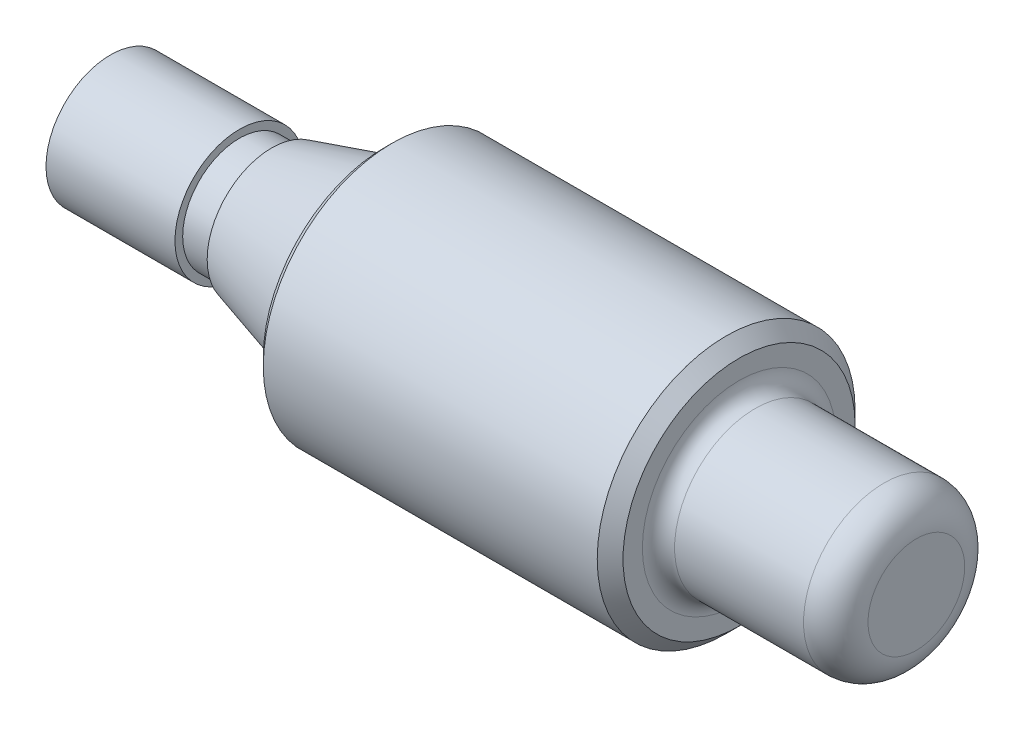
ISO-10303-21;
HEADER;
FILE_DESCRIPTION(('STEP AP214'),'2;1');
FILE_NAME('part.step','',(''),(''),'','','');
FILE_SCHEMA(('AUTOMOTIVE_DESIGN { 1 0 10303 214 1 1 1 1 }'));
ENDSEC;
DATA;
#1=APPLICATION_CONTEXT('core data for automotive mechanical design processes');
#2=APPLICATION_PROTOCOL_DEFINITION('international standard','automotive_design',2000,#1);
#3=PRODUCT_CONTEXT('',#1,'mechanical');
#4=PRODUCT('Part','Part','',(#3));
#5=PRODUCT_RELATED_PRODUCT_CATEGORY('part','',(#4));
#6=PRODUCT_DEFINITION_FORMATION('','',#4);
#7=PRODUCT_DEFINITION_CONTEXT('part definition',#1,'design');
#8=PRODUCT_DEFINITION('design','',#6,#7);
#9=PRODUCT_DEFINITION_SHAPE('','',#8);
#10=(LENGTH_UNIT() NAMED_UNIT(*) SI_UNIT(.MILLI.,.METRE.));
#11=(NAMED_UNIT(*) PLANE_ANGLE_UNIT() SI_UNIT($,.RADIAN.));
#12=(NAMED_UNIT(*) SI_UNIT($,.STERADIAN.) SOLID_ANGLE_UNIT());
#13=UNCERTAINTY_MEASURE_WITH_UNIT(LENGTH_MEASURE(1.E-05),#10,'distance_accuracy_value','');
#14=(GEOMETRIC_REPRESENTATION_CONTEXT(3) GLOBAL_UNCERTAINTY_ASSIGNED_CONTEXT((#13)) GLOBAL_UNIT_ASSIGNED_CONTEXT((#10,
#11,#12)) REPRESENTATION_CONTEXT('',''));
#15=CARTESIAN_POINT('',(0.,0.,0.));
#16=DIRECTION('',(0.,0.,1.));
#17=DIRECTION('',(1.,0.,0.));
#18=AXIS2_PLACEMENT_3D('',#15,#16,#17);
#19=CARTESIAN_POINT('',(-39.6875,0.,0.));
#20=DIRECTION('',(1.,0.,0.));
#21=DIRECTION('',(0.,0.,-1.));
#22=AXIS2_PLACEMENT_3D('',#19,#20,#21);
#23=CYLINDRICAL_SURFACE('',#22,12.7);
#24=CARTESIAN_POINT('',(-11.938,0.,0.));
#25=DIRECTION('',(-1.,0.,0.));
#26=DIRECTION('',(0.,0.,1.));
#27=AXIS2_PLACEMENT_3D('',#24,#25,#26);
#28=CIRCLE('',#27,12.7);
#29=CARTESIAN_POINT('',(-11.938,0.,12.7));
#30=VERTEX_POINT('',#29);
#31=EDGE_CURVE('E13',#30,#30,#28,.F.);
#32=ORIENTED_EDGE('',*,*,#31,.T.);
#33=EDGE_LOOP('',(#32));
#34=FACE_BOUND('',#33,.T.);
#35=CARTESIAN_POINT('',(20.955,0.,0.));
#36=DIRECTION('',(1.,0.,0.));
#37=DIRECTION('',(0.,0.,-1.));
#38=AXIS2_PLACEMENT_3D('',#35,#36,#37);
#39=CIRCLE('',#38,12.7);
#40=CARTESIAN_POINT('',(20.955,0.,-12.7));
#41=VERTEX_POINT('',#40);
#42=EDGE_CURVE('E72',#41,#41,#39,.F.);
#43=ORIENTED_EDGE('',*,*,#42,.T.);
#44=EDGE_LOOP('',(#43));
#45=FACE_BOUND('',#44,.T.);
#46=ADVANCED_FACE('F49',(#34,#45),#23,.T.);
#47=CARTESIAN_POINT('',(22.225,0.,0.));
#48=DIRECTION('',(1.,0.,0.));
#49=DIRECTION('',(0.,0.,-1.));
#50=AXIS2_PLACEMENT_3D('',#47,#48,#49);
#51=PLANE('',#50);
#52=CARTESIAN_POINT('',(22.225,0.,0.));
#53=DIRECTION('',(1.,0.,0.));
#54=DIRECTION('',(0.,0.,-1.));
#55=AXIS2_PLACEMENT_3D('',#52,#53,#54);
#56=CIRCLE('',#55,11.43);
#57=CARTESIAN_POINT('',(22.225,0.,-11.43));
#58=VERTEX_POINT('',#57);
#59=EDGE_CURVE('E69',#58,#58,#56,.T.);
#60=ORIENTED_EDGE('',*,*,#59,.T.);
#61=EDGE_LOOP('',(#60));
#62=FACE_BOUND('',#61,.T.);
#63=CARTESIAN_POINT('',(22.225,0.,0.));
#64=DIRECTION('',(1.,0.,0.));
#65=DIRECTION('',(0.,0.,-1.));
#66=AXIS2_PLACEMENT_3D('',#63,#64,#65);
#67=CIRCLE('',#66,9.525);
#68=CARTESIAN_POINT('',(22.225,0.,-9.525));
#69=VERTEX_POINT('',#68);
#70=EDGE_CURVE('E75',#69,#69,#67,.F.);
#71=ORIENTED_EDGE('',*,*,#70,.T.);
#72=EDGE_LOOP('',(#71));
#73=FACE_BOUND('',#72,.T.);
#74=ADVANCED_FACE('F121',(#62,#73),#51,.T.);
#75=CARTESIAN_POINT('',(22.225,0.,0.));
#76=DIRECTION('',(1.,0.,0.));
#77=DIRECTION('',(0.,0.,-1.));
#78=AXIS2_PLACEMENT_3D('',#75,#76,#77);
#79=CYLINDRICAL_SURFACE('',#78,7.9375);
#80=CARTESIAN_POINT('',(23.8125,0.,0.));
#81=DIRECTION('',(1.,0.,0.));
#82=DIRECTION('',(0.,0.,-1.));
#83=AXIS2_PLACEMENT_3D('',#80,#81,#82);
#84=CIRCLE('',#83,7.9375);
#85=CARTESIAN_POINT('',(23.8125,0.,-7.9375));
#86=VERTEX_POINT('',#85);
#87=EDGE_CURVE('E78',#86,#86,#84,.T.);
#88=ORIENTED_EDGE('',*,*,#87,.T.);
#89=EDGE_LOOP('',(#88));
#90=FACE_BOUND('',#89,.T.);
#91=CARTESIAN_POINT('',(36.5125,0.,0.));
#92=DIRECTION('',(1.,0.,0.));
#93=DIRECTION('',(0.,0.,-1.));
#94=AXIS2_PLACEMENT_3D('',#91,#92,#93);
#95=CIRCLE('',#94,7.9375);
#96=CARTESIAN_POINT('',(36.5125,0.,-7.9375));
#97=VERTEX_POINT('',#96);
#98=EDGE_CURVE('E81',#97,#97,#95,.F.);
#99=ORIENTED_EDGE('',*,*,#98,.T.);
#100=EDGE_LOOP('',(#99));
#101=FACE_BOUND('',#100,.T.);
#102=ADVANCED_FACE('F126',(#90,#101),#79,.T.);
#103=CARTESIAN_POINT('',(39.6875,0.,0.));
#104=DIRECTION('',(1.,0.,0.));
#105=DIRECTION('',(0.,0.,-1.));
#106=AXIS2_PLACEMENT_3D('',#103,#104,#105);
#107=PLANE('',#106);
#108=CARTESIAN_POINT('',(39.6875,0.,0.));
#109=DIRECTION('',(1.,0.,0.));
#110=DIRECTION('',(0.,0.,-1.));
#111=AXIS2_PLACEMENT_3D('',#108,#109,#110);
#112=CIRCLE('',#111,4.7625);
#113=CARTESIAN_POINT('',(39.6875,0.,-4.7625));
#114=VERTEX_POINT('',#113);
#115=EDGE_CURVE('E84',#114,#114,#112,.T.);
#116=ORIENTED_EDGE('',*,*,#115,.T.);
#117=EDGE_LOOP('',(#116));
#118=FACE_BOUND('',#117,.T.);
#119=ADVANCED_FACE('F136',(#118),#107,.T.);
#120=CARTESIAN_POINT('',(36.5125,0.,0.));
#121=DIRECTION('',(1.,0.,0.));
#122=DIRECTION('',(0.,0.,-1.));
#123=AXIS2_PLACEMENT_3D('',#120,#121,#122);
#124=TOROIDAL_SURFACE('',#123,4.7625,3.175);
#125=ORIENTED_EDGE('',*,*,#98,.F.);
#126=EDGE_LOOP('',(#125));
#127=FACE_BOUND('',#126,.T.);
#128=ORIENTED_EDGE('',*,*,#115,.F.);
#129=EDGE_LOOP('',(#128));
#130=FACE_BOUND('',#129,.T.);
#131=ADVANCED_FACE('F132',(#127,#130),#124,.T.);
#132=CARTESIAN_POINT('',(23.8125,0.,0.));
#133=DIRECTION('',(1.,0.,0.));
#134=DIRECTION('',(0.,0.,-1.));
#135=AXIS2_PLACEMENT_3D('',#132,#133,#134);
#136=TOROIDAL_SURFACE('',#135,9.525,1.5875);
#137=ORIENTED_EDGE('',*,*,#70,.F.);
#138=EDGE_LOOP('',(#137));
#139=FACE_BOUND('',#138,.T.);
#140=ORIENTED_EDGE('',*,*,#87,.F.);
#141=EDGE_LOOP('',(#140));
#142=FACE_BOUND('',#141,.T.);
#143=ADVANCED_FACE('F135',(#139,#142),#136,.F.);
#144=CARTESIAN_POINT('',(20.955,0.,0.));
#145=DIRECTION('',(-1.,0.,0.));
#146=DIRECTION('',(0.,0.,1.));
#147=AXIS2_PLACEMENT_3D('',#144,#145,#146);
#148=CONICAL_SURFACE('',#147,12.7,0.78539816339745);
#149=ORIENTED_EDGE('',*,*,#59,.F.);
#150=EDGE_LOOP('',(#149));
#151=FACE_BOUND('',#150,.T.);
#152=ORIENTED_EDGE('',*,*,#42,.F.);
#153=EDGE_LOOP('',(#152));
#154=FACE_BOUND('',#153,.T.);
#155=ADVANCED_FACE('F118',(#151,#154),#148,.T.);
#156=CARTESIAN_POINT('',(-12.7,9.525,0.));
#157=DIRECTION('',(-1.,0.,0.));
#158=DIRECTION('',(0.,0.,1.));
#159=AXIS2_PLACEMENT_3D('',#156,#157,#158);
#160=PLANE('',#159);
#161=CARTESIAN_POINT('',(-12.7,0.,0.));
#162=DIRECTION('',(-1.,0.,0.));
#163=DIRECTION('',(0.,0.,1.));
#164=AXIS2_PLACEMENT_3D('',#161,#162,#163);
#165=CIRCLE('',#164,11.938);
#166=CARTESIAN_POINT('',(-12.7,0.,11.938));
#167=VERTEX_POINT('',#166);
#168=EDGE_CURVE('E56',#167,#167,#165,.T.);
#169=ORIENTED_EDGE('',*,*,#168,.T.);
#170=EDGE_LOOP('',(#169));
#171=FACE_BOUND('',#170,.T.);
#172=CARTESIAN_POINT('',(-12.7,0.,0.));
#173=DIRECTION('',(-1.,0.,0.));
#174=DIRECTION('',(0.,0.,1.));
#175=AXIS2_PLACEMENT_3D('',#172,#173,#174);
#176=CIRCLE('',#175,10.482962794198);
#177=CARTESIAN_POINT('',(-12.7,0.,10.482962794198));
#178=VERTEX_POINT('',#177);
#179=EDGE_CURVE('E60',#178,#178,#176,.F.);
#180=ORIENTED_EDGE('',*,*,#179,.T.);
#181=EDGE_LOOP('',(#180));
#182=FACE_BOUND('',#181,.T.);
#183=ADVANCED_FACE('F108',(#171,#182),#160,.T.);
#184=CARTESIAN_POINT('',(-23.8125,0.,0.));
#185=DIRECTION('',(1.,0.,0.));
#186=DIRECTION('',(0.,0.,-1.));
#187=AXIS2_PLACEMENT_3D('',#184,#185,#186);
#188=CONICAL_SURFACE('',#187,6.35,0.278299659005111);
#189=CARTESIAN_POINT('',(-13.6211041675703,0.,0.));
#190=DIRECTION('',(1.,0.,0.));
#191=DIRECTION('',(0.,0.,-1.));
#192=AXIS2_PLACEMENT_3D('',#189,#190,#191);
#193=CIRCLE('',#192,9.26182738069419);
#194=CARTESIAN_POINT('',(-13.6211041675703,0.,-9.26182738069419));
#195=VERTEX_POINT('',#194);
#196=EDGE_CURVE('E64',#195,#195,#193,.F.);
#197=ORIENTED_EDGE('',*,*,#196,.T.);
#198=EDGE_LOOP('',(#197));
#199=FACE_BOUND('',#198,.T.);
#200=CARTESIAN_POINT('',(-23.8125,0.,0.));
#201=DIRECTION('',(-1.,0.,0.));
#202=DIRECTION('',(0.,0.,1.));
#203=AXIS2_PLACEMENT_3D('',#200,#201,#202);
#204=CIRCLE('',#203,6.35);
#205=CARTESIAN_POINT('',(-23.8125,0.,6.35));
#206=VERTEX_POINT('',#205);
#207=EDGE_CURVE('E97',#206,#206,#204,.T.);
#208=ORIENTED_EDGE('',*,*,#207,.F.);
#209=EDGE_LOOP('',(#208));
#210=FACE_BOUND('',#209,.T.);
#211=ADVANCED_FACE('F105',(#199,#210),#188,.T.);
#212=CARTESIAN_POINT('',(-39.6875,0.,0.));
#213=DIRECTION('',(1.,0.,0.));
#214=DIRECTION('',(0.,0.,-1.));
#215=AXIS2_PLACEMENT_3D('',#212,#213,#214);
#216=PLANE('',#215);
#217=CARTESIAN_POINT('',(-39.6875,0.,0.));
#218=DIRECTION('',(-1.,0.,0.));
#219=DIRECTION('',(0.,0.,1.));
#220=AXIS2_PLACEMENT_3D('',#217,#218,#219);
#221=CIRCLE('',#220,6.35);
#222=CARTESIAN_POINT('',(-39.6875,0.,6.35));
#223=VERTEX_POINT('',#222);
#224=EDGE_CURVE('E87',#223,#223,#221,.T.);
#225=ORIENTED_EDGE('',*,*,#224,.T.);
#226=EDGE_LOOP('',(#225));
#227=FACE_BOUND('',#226,.T.);
#228=ADVANCED_FACE('F107',(#227),#216,.F.);
#229=CARTESIAN_POINT('',(-26.9875,0.,0.));
#230=DIRECTION('',(-1.,0.,0.));
#231=DIRECTION('',(0.,0.,1.));
#232=AXIS2_PLACEMENT_3D('',#229,#230,#231);
#233=CYLINDRICAL_SURFACE('',#232,6.35);
#234=CARTESIAN_POINT('',(-26.9875,0.,0.));
#235=DIRECTION('',(-1.,0.,0.));
#236=DIRECTION('',(0.,0.,1.));
#237=AXIS2_PLACEMENT_3D('',#234,#235,#236);
#238=CIRCLE('',#237,6.35);
#239=CARTESIAN_POINT('',(-26.9875,0.,6.35));
#240=VERTEX_POINT('',#239);
#241=EDGE_CURVE('E90',#240,#240,#238,.F.);
#242=ORIENTED_EDGE('',*,*,#241,.F.);
#243=EDGE_LOOP('',(#242));
#244=FACE_BOUND('',#243,.T.);
#245=ORIENTED_EDGE('',*,*,#224,.F.);
#246=EDGE_LOOP('',(#245));
#247=FACE_BOUND('',#246,.T.);
#248=ADVANCED_FACE('F115',(#244,#247),#233,.T.);
#249=CARTESIAN_POINT('',(-26.9875,0.,0.));
#250=DIRECTION('',(-1.,0.,0.));
#251=DIRECTION('',(0.,0.,1.));
#252=AXIS2_PLACEMENT_3D('',#249,#250,#251);
#253=PLANE('',#252);
#254=ORIENTED_EDGE('',*,*,#241,.T.);
#255=EDGE_LOOP('',(#254));
#256=FACE_BOUND('',#255,.T.);
#257=CARTESIAN_POINT('',(-26.9875,0.,0.));
#258=DIRECTION('',(-1.,0.,0.));
#259=DIRECTION('',(0.,0.,1.));
#260=AXIS2_PLACEMENT_3D('',#257,#258,#259);
#261=CIRCLE('',#260,5.588);
#262=CARTESIAN_POINT('',(-26.9875,0.,5.588));
#263=VERTEX_POINT('',#262);
#264=EDGE_CURVE('E94',#263,#263,#261,.T.);
#265=ORIENTED_EDGE('',*,*,#264,.T.);
#266=EDGE_LOOP('',(#265));
#267=FACE_BOUND('',#266,.T.);
#268=ADVANCED_FACE('F161',(#256,#267),#253,.F.);
#269=CARTESIAN_POINT('',(-23.8125,0.,0.));
#270=DIRECTION('',(-1.,0.,0.));
#271=DIRECTION('',(0.,0.,1.));
#272=AXIS2_PLACEMENT_3D('',#269,#270,#271);
#273=CYLINDRICAL_SURFACE('',#272,5.588);
#274=CARTESIAN_POINT('',(-23.8125,0.,0.));
#275=DIRECTION('',(-1.,0.,0.));
#276=DIRECTION('',(0.,0.,1.));
#277=AXIS2_PLACEMENT_3D('',#274,#275,#276);
#278=CIRCLE('',#277,5.588);
#279=CARTESIAN_POINT('',(-23.8125,0.,5.588));
#280=VERTEX_POINT('',#279);
#281=EDGE_CURVE('E93',#280,#280,#278,.T.);
#282=ORIENTED_EDGE('',*,*,#281,.T.);
#283=EDGE_LOOP('',(#282));
#284=FACE_BOUND('',#283,.T.);
#285=ORIENTED_EDGE('',*,*,#264,.F.);
#286=EDGE_LOOP('',(#285));
#287=FACE_BOUND('',#286,.T.);
#288=ADVANCED_FACE('F151',(#284,#287),#273,.T.);
#289=CARTESIAN_POINT('',(-23.8125,0.,0.));
#290=DIRECTION('',(-1.,0.,0.));
#291=DIRECTION('',(0.,0.,1.));
#292=AXIS2_PLACEMENT_3D('',#289,#290,#291);
#293=PLANE('',#292);
#294=ORIENTED_EDGE('',*,*,#281,.F.);
#295=EDGE_LOOP('',(#294));
#296=FACE_BOUND('',#295,.T.);
#297=ORIENTED_EDGE('',*,*,#207,.T.);
#298=EDGE_LOOP('',(#297));
#299=FACE_BOUND('',#298,.T.);
#300=ADVANCED_FACE('F103',(#296,#299),#293,.T.);
#301=CARTESIAN_POINT('',(-13.97,0.,0.));
#302=DIRECTION('',(-1.,0.,0.));
#303=DIRECTION('',(0.,0.,1.));
#304=AXIS2_PLACEMENT_3D('',#301,#302,#303);
#305=TOROIDAL_SURFACE('',#304,10.482962794198,1.27);
#306=ORIENTED_EDGE('',*,*,#179,.F.);
#307=EDGE_LOOP('',(#306));
#308=FACE_BOUND('',#307,.T.);
#309=ORIENTED_EDGE('',*,*,#196,.F.);
#310=EDGE_LOOP('',(#309));
#311=FACE_BOUND('',#310,.T.);
#312=ADVANCED_FACE('F143',(#308,#311),#305,.F.);
#313=CARTESIAN_POINT('',(-12.7,0.,0.));
#314=DIRECTION('',(1.,0.,0.));
#315=DIRECTION('',(0.,0.,-1.));
#316=AXIS2_PLACEMENT_3D('',#313,#314,#315);
#317=CONICAL_SURFACE('',#316,11.938,0.785398163397452);
#318=ORIENTED_EDGE('',*,*,#31,.F.);
#319=EDGE_LOOP('',(#318));
#320=FACE_BOUND('',#319,.T.);
#321=ORIENTED_EDGE('',*,*,#168,.F.);
#322=EDGE_LOOP('',(#321));
#323=FACE_BOUND('',#322,.T.);
#324=ADVANCED_FACE('F51',(#320,#323),#317,.T.);
#325=CLOSED_SHELL('',(#46,#74,#102,#119,#131,#143,#155,#183,#211,#228,#248,#268,#288,#300,#312,#324));
#326=MANIFOLD_SOLID_BREP('B2',#325);
#327=ADVANCED_BREP_SHAPE_REPRESENTATION('',(#18,#326),#14);
#328=SHAPE_DEFINITION_REPRESENTATION(#9,#327);
ENDSEC;
END-ISO-10303-21;
